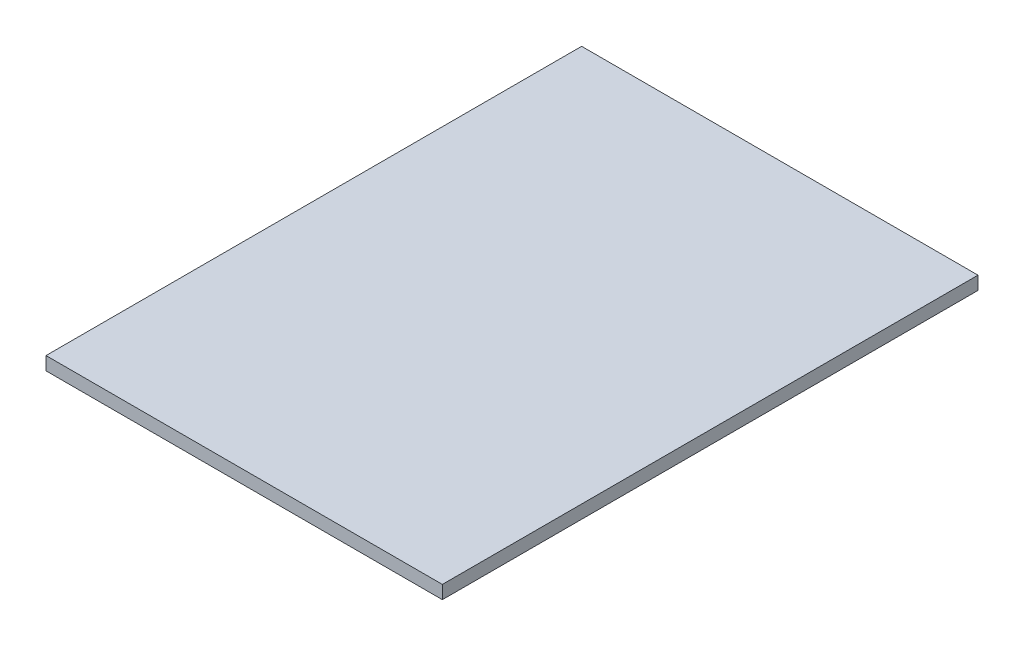
ISO-10303-21;
HEADER;
FILE_DESCRIPTION(('STEP AP214'),'2;1');
FILE_NAME('part.step','',(''),(''),'','','');
FILE_SCHEMA(('AUTOMOTIVE_DESIGN { 1 0 10303 214 1 1 1 1 }'));
ENDSEC;
DATA;
#1=APPLICATION_CONTEXT('core data for automotive mechanical design processes');
#2=APPLICATION_PROTOCOL_DEFINITION('international standard','automotive_design',2000,#1);
#3=PRODUCT_CONTEXT('',#1,'mechanical');
#4=PRODUCT('Part','Part','',(#3));
#5=PRODUCT_RELATED_PRODUCT_CATEGORY('part','',(#4));
#6=PRODUCT_DEFINITION_FORMATION('','',#4);
#7=PRODUCT_DEFINITION_CONTEXT('part definition',#1,'design');
#8=PRODUCT_DEFINITION('design','',#6,#7);
#9=PRODUCT_DEFINITION_SHAPE('','',#8);
#10=(LENGTH_UNIT() NAMED_UNIT(*) SI_UNIT(.MILLI.,.METRE.));
#11=(NAMED_UNIT(*) PLANE_ANGLE_UNIT() SI_UNIT($,.RADIAN.));
#12=(NAMED_UNIT(*) SI_UNIT($,.STERADIAN.) SOLID_ANGLE_UNIT());
#13=UNCERTAINTY_MEASURE_WITH_UNIT(LENGTH_MEASURE(1.E-05),#10,'distance_accuracy_value','');
#14=(GEOMETRIC_REPRESENTATION_CONTEXT(3) GLOBAL_UNCERTAINTY_ASSIGNED_CONTEXT((#13)) GLOBAL_UNIT_ASSIGNED_CONTEXT((#10,
#11,#12)) REPRESENTATION_CONTEXT('',''));
#15=CARTESIAN_POINT('',(0.,0.,0.));
#16=DIRECTION('',(0.,0.,1.));
#17=DIRECTION('',(1.,0.,0.));
#18=AXIS2_PLACEMENT_3D('',#15,#16,#17);
#19=CARTESIAN_POINT('',(178.562,11.938,241.3));
#20=DIRECTION('',(-1.,0.,0.));
#21=DIRECTION('',(0.,0.,1.));
#22=AXIS2_PLACEMENT_3D('',#19,#20,#21);
#23=PLANE('',#22);
#24=DIRECTION('',(0.,0.,-1.));
#25=VECTOR('',#24,1.);
#26=CARTESIAN_POINT('',(178.562,0.,241.3));
#27=LINE('',#26,#25);
#28=CARTESIAN_POINT('',(178.562,0.,241.3));
#29=VERTEX_POINT('',#28);
#30=CARTESIAN_POINT('',(178.562,0.,-241.3));
#31=VERTEX_POINT('',#30);
#32=EDGE_CURVE('E96',#29,#31,#27,.T.);
#33=ORIENTED_EDGE('',*,*,#32,.T.);
#34=DIRECTION('',(0.,-1.,0.));
#35=VECTOR('',#34,1.);
#36=CARTESIAN_POINT('',(178.562,11.938,-241.3));
#37=LINE('',#36,#35);
#38=CARTESIAN_POINT('',(178.562,11.938,-241.3));
#39=VERTEX_POINT('',#38);
#40=EDGE_CURVE('E11',#39,#31,#37,.T.);
#41=ORIENTED_EDGE('',*,*,#40,.F.);
#42=DIRECTION('',(0.,0.,-1.));
#43=VECTOR('',#42,1.);
#44=CARTESIAN_POINT('',(178.562,11.938,241.3));
#45=LINE('',#44,#43);
#46=CARTESIAN_POINT('',(178.562,11.938,241.3));
#47=VERTEX_POINT('',#46);
#48=EDGE_CURVE('E84',#47,#39,#45,.T.);
#49=ORIENTED_EDGE('',*,*,#48,.F.);
#50=DIRECTION('',(0.,-1.,0.));
#51=VECTOR('',#50,1.);
#52=CARTESIAN_POINT('',(178.562,11.938,241.3));
#53=LINE('',#52,#51);
#54=EDGE_CURVE('E92',#47,#29,#53,.T.);
#55=ORIENTED_EDGE('',*,*,#54,.T.);
#56=EDGE_LOOP('',(#33,#41,#49,#55));
#57=FACE_BOUND('',#56,.T.);
#58=ADVANCED_FACE('F33',(#57),#23,.F.);
#59=CARTESIAN_POINT('',(-178.562,11.938,-241.3));
#60=DIRECTION('',(0.,0.,1.));
#61=DIRECTION('',(1.,0.,0.));
#62=AXIS2_PLACEMENT_3D('',#59,#60,#61);
#63=PLANE('',#62);
#64=DIRECTION('',(-1.,0.,0.));
#65=VECTOR('',#64,1.);
#66=CARTESIAN_POINT('',(-178.562,0.,-241.3));
#67=LINE('',#66,#65);
#68=CARTESIAN_POINT('',(-178.562,0.,-241.3));
#69=VERTEX_POINT('',#68);
#70=EDGE_CURVE('E88',#31,#69,#67,.T.);
#71=ORIENTED_EDGE('',*,*,#70,.T.);
#72=DIRECTION('',(0.,-1.,0.));
#73=VECTOR('',#72,1.);
#74=CARTESIAN_POINT('',(-178.562,11.938,-241.3));
#75=LINE('',#74,#73);
#76=CARTESIAN_POINT('',(-178.562,11.938,-241.3));
#77=VERTEX_POINT('',#76);
#78=EDGE_CURVE('E41',#77,#69,#75,.T.);
#79=ORIENTED_EDGE('',*,*,#78,.F.);
#80=DIRECTION('',(-1.,0.,0.));
#81=VECTOR('',#80,1.);
#82=CARTESIAN_POINT('',(-178.562,11.938,-241.3));
#83=LINE('',#82,#81);
#84=EDGE_CURVE('E79',#39,#77,#83,.T.);
#85=ORIENTED_EDGE('',*,*,#84,.F.);
#86=ORIENTED_EDGE('',*,*,#40,.T.);
#87=EDGE_LOOP('',(#71,#79,#85,#86));
#88=FACE_BOUND('',#87,.T.);
#89=ADVANCED_FACE('F87',(#88),#63,.F.);
#90=CARTESIAN_POINT('',(-178.562,11.938,241.3));
#91=DIRECTION('',(1.,0.,0.));
#92=DIRECTION('',(0.,0.,-1.));
#93=AXIS2_PLACEMENT_3D('',#90,#91,#92);
#94=PLANE('',#93);
#95=DIRECTION('',(0.,0.,1.));
#96=VECTOR('',#95,1.);
#97=CARTESIAN_POINT('',(-178.562,0.,241.3));
#98=LINE('',#97,#96);
#99=CARTESIAN_POINT('',(-178.562,0.,241.3));
#100=VERTEX_POINT('',#99);
#101=EDGE_CURVE('E66',#69,#100,#98,.T.);
#102=ORIENTED_EDGE('',*,*,#101,.T.);
#103=DIRECTION('',(0.,-1.,0.));
#104=VECTOR('',#103,1.);
#105=CARTESIAN_POINT('',(-178.562,11.938,241.3));
#106=LINE('',#105,#104);
#107=CARTESIAN_POINT('',(-178.562,11.938,241.3));
#108=VERTEX_POINT('',#107);
#109=EDGE_CURVE('E89',#108,#100,#106,.T.);
#110=ORIENTED_EDGE('',*,*,#109,.F.);
#111=DIRECTION('',(0.,0.,1.));
#112=VECTOR('',#111,1.);
#113=CARTESIAN_POINT('',(-178.562,11.938,241.3));
#114=LINE('',#113,#112);
#115=EDGE_CURVE('E82',#77,#108,#114,.T.);
#116=ORIENTED_EDGE('',*,*,#115,.F.);
#117=ORIENTED_EDGE('',*,*,#78,.T.);
#118=EDGE_LOOP('',(#102,#110,#116,#117));
#119=FACE_BOUND('',#118,.T.);
#120=ADVANCED_FACE('F90',(#119),#94,.F.);
#121=CARTESIAN_POINT('',(-178.562,11.938,241.3));
#122=DIRECTION('',(0.,0.,-1.));
#123=DIRECTION('',(-1.,0.,0.));
#124=AXIS2_PLACEMENT_3D('',#121,#122,#123);
#125=PLANE('',#124);
#126=DIRECTION('',(1.,0.,0.));
#127=VECTOR('',#126,1.);
#128=CARTESIAN_POINT('',(-178.562,0.,241.3));
#129=LINE('',#128,#127);
#130=EDGE_CURVE('E72',#100,#29,#129,.T.);
#131=ORIENTED_EDGE('',*,*,#130,.T.);
#132=ORIENTED_EDGE('',*,*,#54,.F.);
#133=DIRECTION('',(1.,0.,0.));
#134=VECTOR('',#133,1.);
#135=CARTESIAN_POINT('',(-178.562,11.938,241.3));
#136=LINE('',#135,#134);
#137=EDGE_CURVE('E49',#108,#47,#136,.T.);
#138=ORIENTED_EDGE('',*,*,#137,.F.);
#139=ORIENTED_EDGE('',*,*,#109,.T.);
#140=EDGE_LOOP('',(#131,#132,#138,#139));
#141=FACE_BOUND('',#140,.T.);
#142=ADVANCED_FACE('F103',(#141),#125,.F.);
#143=CARTESIAN_POINT('',(0.,11.938,0.));
#144=DIRECTION('',(0.,-1.,0.));
#145=DIRECTION('',(0.,0.,-1.));
#146=AXIS2_PLACEMENT_3D('',#143,#144,#145);
#147=PLANE('',#146);
#148=ORIENTED_EDGE('',*,*,#48,.T.);
#149=ORIENTED_EDGE('',*,*,#84,.T.);
#150=ORIENTED_EDGE('',*,*,#115,.T.);
#151=ORIENTED_EDGE('',*,*,#137,.T.);
#152=EDGE_LOOP('',(#148,#149,#150,#151));
#153=FACE_BOUND('',#152,.T.);
#154=ADVANCED_FACE('F80',(#153),#147,.F.);
#155=CARTESIAN_POINT('',(0.,0.,0.));
#156=DIRECTION('',(0.,-1.,0.));
#157=DIRECTION('',(0.,0.,-1.));
#158=AXIS2_PLACEMENT_3D('',#155,#156,#157);
#159=PLANE('',#158);
#160=ORIENTED_EDGE('',*,*,#32,.F.);
#161=ORIENTED_EDGE('',*,*,#130,.F.);
#162=ORIENTED_EDGE('',*,*,#101,.F.);
#163=ORIENTED_EDGE('',*,*,#70,.F.);
#164=EDGE_LOOP('',(#160,#161,#162,#163));
#165=FACE_BOUND('',#164,.T.);
#166=ADVANCED_FACE('F106',(#165),#159,.T.);
#167=CLOSED_SHELL('',(#58,#89,#120,#142,#154,#166));
#168=MANIFOLD_SOLID_BREP('B2',#167);
#169=ADVANCED_BREP_SHAPE_REPRESENTATION('',(#18,#168),#14);
#170=SHAPE_DEFINITION_REPRESENTATION(#9,#169);
ENDSEC;
END-ISO-10303-21;
